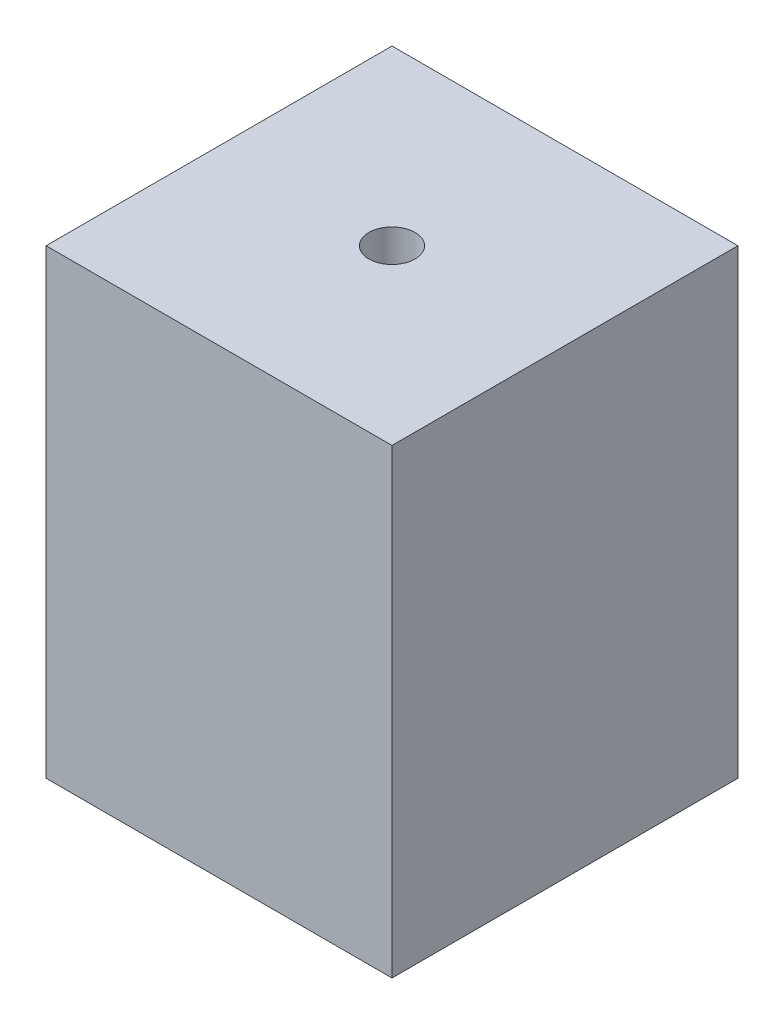
ISO-10303-21;
HEADER;
FILE_DESCRIPTION(('STEP AP214'),'2;1');
FILE_NAME('part.step','',(''),(''),'','','');
FILE_SCHEMA(('AUTOMOTIVE_DESIGN { 1 0 10303 214 1 1 1 1 }'));
ENDSEC;
DATA;
#1=APPLICATION_CONTEXT('core data for automotive mechanical design processes');
#2=APPLICATION_PROTOCOL_DEFINITION('international standard','automotive_design',2000,#1);
#3=PRODUCT_CONTEXT('',#1,'mechanical');
#4=PRODUCT('Part','Part','',(#3));
#5=PRODUCT_RELATED_PRODUCT_CATEGORY('part','',(#4));
#6=PRODUCT_DEFINITION_FORMATION('','',#4);
#7=PRODUCT_DEFINITION_CONTEXT('part definition',#1,'design');
#8=PRODUCT_DEFINITION('design','',#6,#7);
#9=PRODUCT_DEFINITION_SHAPE('','',#8);
#10=(LENGTH_UNIT() NAMED_UNIT(*) SI_UNIT(.MILLI.,.METRE.));
#11=(NAMED_UNIT(*) PLANE_ANGLE_UNIT() SI_UNIT($,.RADIAN.));
#12=(NAMED_UNIT(*) SI_UNIT($,.STERADIAN.) SOLID_ANGLE_UNIT());
#13=UNCERTAINTY_MEASURE_WITH_UNIT(LENGTH_MEASURE(1.E-05),#10,'distance_accuracy_value','');
#14=(GEOMETRIC_REPRESENTATION_CONTEXT(3) GLOBAL_UNCERTAINTY_ASSIGNED_CONTEXT((#13)) GLOBAL_UNIT_ASSIGNED_CONTEXT((#10,
#11,#12)) REPRESENTATION_CONTEXT('',''));
#15=CARTESIAN_POINT('',(0.,0.,0.));
#16=DIRECTION('',(0.,0.,1.));
#17=DIRECTION('',(1.,0.,0.));
#18=AXIS2_PLACEMENT_3D('',#15,#16,#17);
#19=CARTESIAN_POINT('',(0.,50.8,0.));
#20=DIRECTION('',(1.,0.,0.));
#21=DIRECTION('',(0.,0.,-1.));
#22=AXIS2_PLACEMENT_3D('',#19,#20,#21);
#23=PLANE('',#22);
#24=DIRECTION('',(0.,0.,1.));
#25=VECTOR('',#24,1.);
#26=CARTESIAN_POINT('',(0.,0.,0.));
#27=LINE('',#26,#25);
#28=CARTESIAN_POINT('',(0.,0.,-38.1));
#29=VERTEX_POINT('',#28);
#30=CARTESIAN_POINT('',(0.,0.,0.));
#31=VERTEX_POINT('',#30);
#32=EDGE_CURVE('E96',#29,#31,#27,.T.);
#33=ORIENTED_EDGE('',*,*,#32,.T.);
#34=DIRECTION('',(0.,-1.,0.));
#35=VECTOR('',#34,1.);
#36=CARTESIAN_POINT('',(0.,50.8,0.));
#37=LINE('',#36,#35);
#38=CARTESIAN_POINT('',(0.,50.8,0.));
#39=VERTEX_POINT('',#38);
#40=EDGE_CURVE('E11',#39,#31,#37,.T.);
#41=ORIENTED_EDGE('',*,*,#40,.F.);
#42=DIRECTION('',(0.,0.,1.));
#43=VECTOR('',#42,1.);
#44=CARTESIAN_POINT('',(0.,50.8,0.));
#45=LINE('',#44,#43);
#46=CARTESIAN_POINT('',(0.,50.8,-38.1));
#47=VERTEX_POINT('',#46);
#48=EDGE_CURVE('E84',#47,#39,#45,.T.);
#49=ORIENTED_EDGE('',*,*,#48,.F.);
#50=DIRECTION('',(0.,-1.,0.));
#51=VECTOR('',#50,1.);
#52=CARTESIAN_POINT('',(0.,50.8,-38.1));
#53=LINE('',#52,#51);
#54=EDGE_CURVE('E92',#47,#29,#53,.T.);
#55=ORIENTED_EDGE('',*,*,#54,.T.);
#56=EDGE_LOOP('',(#33,#41,#49,#55));
#57=FACE_BOUND('',#56,.T.);
#58=ADVANCED_FACE('F33',(#57),#23,.F.);
#59=CARTESIAN_POINT('',(0.,50.8,0.));
#60=DIRECTION('',(0.,0.,-1.));
#61=DIRECTION('',(-1.,0.,0.));
#62=AXIS2_PLACEMENT_3D('',#59,#60,#61);
#63=PLANE('',#62);
#64=DIRECTION('',(1.,0.,0.));
#65=VECTOR('',#64,1.);
#66=CARTESIAN_POINT('',(0.,0.,0.));
#67=LINE('',#66,#65);
#68=CARTESIAN_POINT('',(38.1,0.,0.));
#69=VERTEX_POINT('',#68);
#70=EDGE_CURVE('E88',#31,#69,#67,.T.);
#71=ORIENTED_EDGE('',*,*,#70,.T.);
#72=DIRECTION('',(0.,-1.,0.));
#73=VECTOR('',#72,1.);
#74=CARTESIAN_POINT('',(38.1,50.8,0.));
#75=LINE('',#74,#73);
#76=CARTESIAN_POINT('',(38.1,50.8,0.));
#77=VERTEX_POINT('',#76);
#78=EDGE_CURVE('E41',#77,#69,#75,.T.);
#79=ORIENTED_EDGE('',*,*,#78,.F.);
#80=DIRECTION('',(1.,0.,0.));
#81=VECTOR('',#80,1.);
#82=CARTESIAN_POINT('',(0.,50.8,0.));
#83=LINE('',#82,#81);
#84=EDGE_CURVE('E79',#39,#77,#83,.T.);
#85=ORIENTED_EDGE('',*,*,#84,.F.);
#86=ORIENTED_EDGE('',*,*,#40,.T.);
#87=EDGE_LOOP('',(#71,#79,#85,#86));
#88=FACE_BOUND('',#87,.T.);
#89=ADVANCED_FACE('F87',(#88),#63,.F.);
#90=CARTESIAN_POINT('',(38.1,50.8,0.));
#91=DIRECTION('',(-1.,0.,0.));
#92=DIRECTION('',(0.,0.,1.));
#93=AXIS2_PLACEMENT_3D('',#90,#91,#92);
#94=PLANE('',#93);
#95=DIRECTION('',(0.,0.,-1.));
#96=VECTOR('',#95,1.);
#97=CARTESIAN_POINT('',(38.1,0.,0.));
#98=LINE('',#97,#96);
#99=CARTESIAN_POINT('',(38.1,0.,-38.1));
#100=VERTEX_POINT('',#99);
#101=EDGE_CURVE('E66',#69,#100,#98,.T.);
#102=ORIENTED_EDGE('',*,*,#101,.T.);
#103=DIRECTION('',(0.,-1.,0.));
#104=VECTOR('',#103,1.);
#105=CARTESIAN_POINT('',(38.1,50.8,-38.1));
#106=LINE('',#105,#104);
#107=CARTESIAN_POINT('',(38.1,50.8,-38.1));
#108=VERTEX_POINT('',#107);
#109=EDGE_CURVE('E89',#108,#100,#106,.T.);
#110=ORIENTED_EDGE('',*,*,#109,.F.);
#111=DIRECTION('',(0.,0.,-1.));
#112=VECTOR('',#111,1.);
#113=CARTESIAN_POINT('',(38.1,50.8,0.));
#114=LINE('',#113,#112);
#115=EDGE_CURVE('E82',#77,#108,#114,.T.);
#116=ORIENTED_EDGE('',*,*,#115,.F.);
#117=ORIENTED_EDGE('',*,*,#78,.T.);
#118=EDGE_LOOP('',(#102,#110,#116,#117));
#119=FACE_BOUND('',#118,.T.);
#120=ADVANCED_FACE('F90',(#119),#94,.F.);
#121=CARTESIAN_POINT('',(0.,50.8,-38.1));
#122=DIRECTION('',(0.,0.,1.));
#123=DIRECTION('',(1.,0.,0.));
#124=AXIS2_PLACEMENT_3D('',#121,#122,#123);
#125=PLANE('',#124);
#126=DIRECTION('',(-1.,0.,0.));
#127=VECTOR('',#126,1.);
#128=CARTESIAN_POINT('',(0.,0.,-38.1));
#129=LINE('',#128,#127);
#130=EDGE_CURVE('E72',#100,#29,#129,.T.);
#131=ORIENTED_EDGE('',*,*,#130,.T.);
#132=ORIENTED_EDGE('',*,*,#54,.F.);
#133=DIRECTION('',(-1.,0.,0.));
#134=VECTOR('',#133,1.);
#135=CARTESIAN_POINT('',(0.,50.8,-38.1));
#136=LINE('',#135,#134);
#137=EDGE_CURVE('E49',#108,#47,#136,.T.);
#138=ORIENTED_EDGE('',*,*,#137,.F.);
#139=ORIENTED_EDGE('',*,*,#109,.T.);
#140=EDGE_LOOP('',(#131,#132,#138,#139));
#141=FACE_BOUND('',#140,.T.);
#142=ADVANCED_FACE('F104',(#141),#125,.F.);
#143=CARTESIAN_POINT('',(0.,50.8,0.));
#144=DIRECTION('',(0.,-1.,0.));
#145=DIRECTION('',(0.,0.,-1.));
#146=AXIS2_PLACEMENT_3D('',#143,#144,#145);
#147=PLANE('',#146);
#148=CARTESIAN_POINT('',(19.05,50.8,-19.05));
#149=DIRECTION('',(0.,1.,0.));
#150=DIRECTION('',(0.,0.,1.));
#151=AXIS2_PLACEMENT_3D('',#148,#149,#150);
#152=CIRCLE('',#151,2.54);
#153=CARTESIAN_POINT('',(19.05,50.8,-16.51));
#154=VERTEX_POINT('',#153);
#155=EDGE_CURVE('E110',#154,#154,#152,.T.);
#156=ORIENTED_EDGE('',*,*,#155,.F.);
#157=EDGE_LOOP('',(#156));
#158=FACE_BOUND('',#157,.T.);
#159=ORIENTED_EDGE('',*,*,#48,.T.);
#160=ORIENTED_EDGE('',*,*,#84,.T.);
#161=ORIENTED_EDGE('',*,*,#115,.T.);
#162=ORIENTED_EDGE('',*,*,#137,.T.);
#163=EDGE_LOOP('',(#159,#160,#161,#162));
#164=FACE_BOUND('',#163,.T.);
#165=ADVANCED_FACE('F80',(#158,#164),#147,.F.);
#166=CARTESIAN_POINT('',(0.,0.,0.));
#167=DIRECTION('',(0.,-1.,0.));
#168=DIRECTION('',(0.,0.,-1.));
#169=AXIS2_PLACEMENT_3D('',#166,#167,#168);
#170=PLANE('',#169);
#171=ORIENTED_EDGE('',*,*,#32,.F.);
#172=ORIENTED_EDGE('',*,*,#130,.F.);
#173=ORIENTED_EDGE('',*,*,#101,.F.);
#174=ORIENTED_EDGE('',*,*,#70,.F.);
#175=EDGE_LOOP('',(#171,#172,#173,#174));
#176=FACE_BOUND('',#175,.T.);
#177=ADVANCED_FACE('F107',(#176),#170,.T.);
#178=CARTESIAN_POINT('',(19.05,44.45,-19.05));
#179=DIRECTION('',(0.,1.,0.));
#180=DIRECTION('',(0.,0.,1.));
#181=AXIS2_PLACEMENT_3D('',#178,#179,#180);
#182=CYLINDRICAL_SURFACE('',#181,2.54);
#183=CARTESIAN_POINT('',(19.05,44.45,-19.05));
#184=DIRECTION('',(0.,1.,0.));
#185=DIRECTION('',(0.,0.,1.));
#186=AXIS2_PLACEMENT_3D('',#183,#184,#185);
#187=CIRCLE('',#186,2.54);
#188=CARTESIAN_POINT('',(19.05,44.45,-16.51));
#189=VERTEX_POINT('',#188);
#190=EDGE_CURVE('E99',#189,#189,#187,.T.);
#191=ORIENTED_EDGE('',*,*,#190,.F.);
#192=EDGE_LOOP('',(#191));
#193=FACE_BOUND('',#192,.T.);
#194=ORIENTED_EDGE('',*,*,#155,.T.);
#195=EDGE_LOOP('',(#194));
#196=FACE_BOUND('',#195,.T.);
#197=ADVANCED_FACE('F118',(#193,#196),#182,.F.);
#198=CARTESIAN_POINT('',(19.05,44.45,-19.05));
#199=DIRECTION('',(0.,1.,0.));
#200=DIRECTION('',(0.,0.,1.));
#201=AXIS2_PLACEMENT_3D('',#198,#199,#200);
#202=PLANE('',#201);
#203=ORIENTED_EDGE('',*,*,#190,.T.);
#204=EDGE_LOOP('',(#203));
#205=FACE_BOUND('',#204,.T.);
#206=ADVANCED_FACE('F116',(#205),#202,.T.);
#207=CLOSED_SHELL('',(#58,#89,#120,#142,#165,#177,#197,#206));
#208=MANIFOLD_SOLID_BREP('B2',#207);
#209=ADVANCED_BREP_SHAPE_REPRESENTATION('',(#18,#208),#14);
#210=SHAPE_DEFINITION_REPRESENTATION(#9,#209);
ENDSEC;
END-ISO-10303-21;
